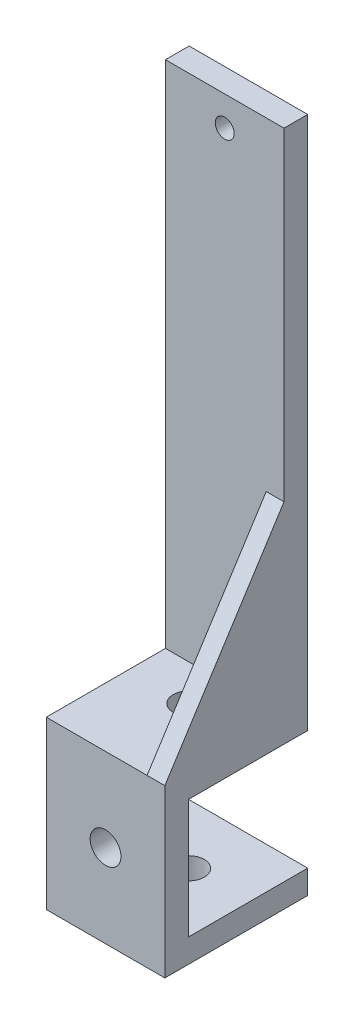
ISO-10303-21;
HEADER;
FILE_DESCRIPTION(('STEP AP214'),'2;1');
FILE_NAME('part.step','',(''),(''),'','','');
FILE_SCHEMA(('AUTOMOTIVE_DESIGN { 1 0 10303 214 1 1 1 1 }'));
ENDSEC;
DATA;
#1=APPLICATION_CONTEXT('core data for automotive mechanical design processes');
#2=APPLICATION_PROTOCOL_DEFINITION('international standard','automotive_design',2000,#1);
#3=PRODUCT_CONTEXT('',#1,'mechanical');
#4=PRODUCT('Part','Part','',(#3));
#5=PRODUCT_RELATED_PRODUCT_CATEGORY('part','',(#4));
#6=PRODUCT_DEFINITION_FORMATION('','',#4);
#7=PRODUCT_DEFINITION_CONTEXT('part definition',#1,'design');
#8=PRODUCT_DEFINITION('design','',#6,#7);
#9=PRODUCT_DEFINITION_SHAPE('','',#8);
#10=(LENGTH_UNIT() NAMED_UNIT(*) SI_UNIT(.MILLI.,.METRE.));
#11=(NAMED_UNIT(*) PLANE_ANGLE_UNIT() SI_UNIT($,.RADIAN.));
#12=(NAMED_UNIT(*) SI_UNIT($,.STERADIAN.) SOLID_ANGLE_UNIT());
#13=UNCERTAINTY_MEASURE_WITH_UNIT(LENGTH_MEASURE(1.E-05),#10,'distance_accuracy_value','');
#14=(GEOMETRIC_REPRESENTATION_CONTEXT(3) GLOBAL_UNCERTAINTY_ASSIGNED_CONTEXT((#13)) GLOBAL_UNIT_ASSIGNED_CONTEXT((#10,
#11,#12)) REPRESENTATION_CONTEXT('',''));
#15=CARTESIAN_POINT('',(0.,0.,0.));
#16=DIRECTION('',(0.,0.,1.));
#17=DIRECTION('',(1.,0.,0.));
#18=AXIS2_PLACEMENT_3D('',#15,#16,#17);
#19=CARTESIAN_POINT('',(-9.20967706060124,-71.3608856625275,20.1));
#20=DIRECTION('',(0.,0.,1.));
#21=DIRECTION('',(1.,0.,0.));
#22=AXIS2_PLACEMENT_3D('',#19,#20,#21);
#23=PLANE('',#22);
#24=CARTESIAN_POINT('',(-19.2096770606013,-57.3108856625275,20.1));
#25=DIRECTION('',(0.,0.,-1.));
#26=DIRECTION('',(-1.,0.,0.));
#27=AXIS2_PLACEMENT_3D('',#24,#25,#26);
#28=CIRCLE('',#27,2.6);
#29=CARTESIAN_POINT('',(-21.8096770606012,-57.3108856625275,20.1));
#30=VERTEX_POINT('',#29);
#31=EDGE_CURVE('E180',#30,#30,#28,.T.);
#32=ORIENTED_EDGE('',*,*,#31,.F.);
#33=EDGE_LOOP('',(#32));
#34=FACE_BOUND('',#33,.T.);
#35=DIRECTION('',(1.,0.,0.));
#36=VECTOR('',#35,1.);
#37=CARTESIAN_POINT('',(-9.20967706060124,-67.3608856625275,20.1));
#38=LINE('',#37,#36);
#39=CARTESIAN_POINT('',(-29.2096770606013,-67.3608856625275,20.1));
#40=VERTEX_POINT('',#39);
#41=CARTESIAN_POINT('',(-9.20967706060124,-67.3608856625275,20.1));
#42=VERTEX_POINT('',#41);
#43=EDGE_CURVE('E194',#40,#42,#38,.T.);
#44=ORIENTED_EDGE('',*,*,#43,.F.);
#45=DIRECTION('',(0.,1.,0.));
#46=VECTOR('',#45,1.);
#47=CARTESIAN_POINT('',(-29.2096770606013,-71.3608856625275,20.1));
#48=LINE('',#47,#46);
#49=CARTESIAN_POINT('',(-29.2096770606013,-47.2608856625275,20.1));
#50=VERTEX_POINT('',#49);
#51=EDGE_CURVE('E65',#40,#50,#48,.T.);
#52=ORIENTED_EDGE('',*,*,#51,.T.);
#53=DIRECTION('',(1.,0.,0.));
#54=VECTOR('',#53,1.);
#55=CARTESIAN_POINT('',(-9.20967706060125,-47.2608856625275,20.1));
#56=LINE('',#55,#54);
#57=CARTESIAN_POINT('',(-9.20967706060125,-47.2608856625275,20.1));
#58=VERTEX_POINT('',#57);
#59=EDGE_CURVE('E213',#50,#58,#56,.T.);
#60=ORIENTED_EDGE('',*,*,#59,.T.);
#61=DIRECTION('',(0.,1.,0.));
#62=VECTOR('',#61,1.);
#63=CARTESIAN_POINT('',(-9.20967706060124,-71.3608856625275,20.1));
#64=LINE('',#63,#62);
#65=EDGE_CURVE('E225',#42,#58,#64,.T.);
#66=ORIENTED_EDGE('',*,*,#65,.F.);
#67=EDGE_LOOP('',(#44,#52,#60,#66));
#68=FACE_BOUND('',#67,.T.);
#69=ADVANCED_FACE('F39',(#34,#68),#23,.F.);
#70=CARTESIAN_POINT('',(-9.20967706060125,-47.2608856625275,4.));
#71=DIRECTION('',(0.,1.,0.));
#72=DIRECTION('',(-1.,0.,0.));
#73=AXIS2_PLACEMENT_3D('',#70,#71,#72);
#74=PLANE('',#73);
#75=CARTESIAN_POINT('',(-19.2096770606013,-47.2608856625275,10.094759339097));
#76=DIRECTION('',(0.,-1.,0.));
#77=DIRECTION('',(1.,0.,0.));
#78=AXIS2_PLACEMENT_3D('',#75,#76,#77);
#79=CIRCLE('',#78,2.6);
#80=CARTESIAN_POINT('',(-16.6096770606013,-47.2608856625275,10.094759339097));
#81=VERTEX_POINT('',#80);
#82=EDGE_CURVE('E184',#81,#81,#79,.T.);
#83=ORIENTED_EDGE('',*,*,#82,.F.);
#84=EDGE_LOOP('',(#83));
#85=FACE_BOUND('',#84,.T.);
#86=ORIENTED_EDGE('',*,*,#59,.F.);
#87=DIRECTION('',(0.,0.,-1.));
#88=VECTOR('',#87,1.);
#89=CARTESIAN_POINT('',(-29.2096770606013,-47.2608856625275,4.));
#90=LINE('',#89,#88);
#91=CARTESIAN_POINT('',(-29.2096770606013,-47.2608856625275,0.));
#92=VERTEX_POINT('',#91);
#93=EDGE_CURVE('E277',#50,#92,#90,.T.);
#94=ORIENTED_EDGE('',*,*,#93,.T.);
#95=DIRECTION('',(1.,0.,0.));
#96=VECTOR('',#95,1.);
#97=CARTESIAN_POINT('',(-9.20967706060125,-47.2608856625275,0.));
#98=LINE('',#97,#96);
#99=CARTESIAN_POINT('',(-9.20967706060125,-47.2608856625275,0.));
#100=VERTEX_POINT('',#99);
#101=EDGE_CURVE('E255',#92,#100,#98,.T.);
#102=ORIENTED_EDGE('',*,*,#101,.T.);
#103=DIRECTION('',(0.,0.,-1.));
#104=VECTOR('',#103,1.);
#105=CARTESIAN_POINT('',(-9.20967706060125,-47.2608856625275,4.));
#106=LINE('',#105,#104);
#107=EDGE_CURVE('E261',#58,#100,#106,.T.);
#108=ORIENTED_EDGE('',*,*,#107,.F.);
#109=EDGE_LOOP('',(#86,#94,#102,#108));
#110=FACE_BOUND('',#109,.T.);
#111=ADVANCED_FACE('F306',(#85,#110),#74,.F.);
#112=CARTESIAN_POINT('',(0.,0.,4.));
#113=DIRECTION('',(0.,0.,-1.));
#114=DIRECTION('',(-1.,0.,0.));
#115=AXIS2_PLACEMENT_3D('',#112,#113,#114);
#116=PLANE('',#115);
#117=CARTESIAN_POINT('',(-19.2096770606013,37.7391143374725,4.));
#118=DIRECTION('',(0.,0.,-1.));
#119=DIRECTION('',(-1.,0.,0.));
#120=AXIS2_PLACEMENT_3D('',#117,#118,#119);
#121=CIRCLE('',#120,1.6);
#122=CARTESIAN_POINT('',(-20.8096770606013,37.7391143374725,4.));
#123=VERTEX_POINT('',#122);
#124=EDGE_CURVE('E168',#123,#123,#121,.T.);
#125=ORIENTED_EDGE('',*,*,#124,.T.);
#126=EDGE_LOOP('',(#125));
#127=FACE_BOUND('',#126,.T.);
#128=CARTESIAN_POINT('',(-19.2096770606013,-38.2608856625275,4.));
#129=DIRECTION('',(0.,0.,-1.));
#130=DIRECTION('',(-1.,0.,0.));
#131=AXIS2_PLACEMENT_3D('',#128,#129,#130);
#132=CIRCLE('',#131,1.6);
#133=CARTESIAN_POINT('',(-20.8096770606013,-38.2608856625275,4.));
#134=VERTEX_POINT('',#133);
#135=EDGE_CURVE('E161',#134,#134,#132,.T.);
#136=ORIENTED_EDGE('',*,*,#135,.T.);
#137=EDGE_LOOP('',(#136));
#138=FACE_BOUND('',#137,.T.);
#139=DIRECTION('',(0.,1.,0.));
#140=VECTOR('',#139,1.);
#141=CARTESIAN_POINT('',(-12.2096770606013,-11.8482809730409,4.));
#142=LINE('',#141,#140);
#143=CARTESIAN_POINT('',(-12.2096770606012,-43.2608856625275,4.));
#144=VERTEX_POINT('',#143);
#145=CARTESIAN_POINT('',(-12.2096770606013,-11.8482809730409,4.));
#146=VERTEX_POINT('',#145);
#147=EDGE_CURVE('E143',#144,#146,#142,.T.);
#148=ORIENTED_EDGE('',*,*,#147,.T.);
#149=DIRECTION('',(1.,0.,0.));
#150=VECTOR('',#149,1.);
#151=CARTESIAN_POINT('',(-12.2096770606013,-11.8482809730409,4.));
#152=LINE('',#151,#150);
#153=CARTESIAN_POINT('',(-9.20967706060125,-11.8482809730409,4.));
#154=VERTEX_POINT('',#153);
#155=EDGE_CURVE('E130',#146,#154,#152,.T.);
#156=ORIENTED_EDGE('',*,*,#155,.T.);
#157=DIRECTION('',(0.,1.,0.));
#158=VECTOR('',#157,1.);
#159=CARTESIAN_POINT('',(-9.20967706060126,42.7391143374725,4.));
#160=LINE('',#159,#158);
#161=CARTESIAN_POINT('',(-9.20967706060126,42.7391143374725,4.));
#162=VERTEX_POINT('',#161);
#163=EDGE_CURVE('E251',#154,#162,#160,.T.);
#164=ORIENTED_EDGE('',*,*,#163,.T.);
#165=DIRECTION('',(-1.,0.,0.));
#166=VECTOR('',#165,1.);
#167=CARTESIAN_POINT('',(-9.20967706060126,42.7391143374725,4.));
#168=LINE('',#167,#166);
#169=CARTESIAN_POINT('',(-29.2096770606013,42.7391143374725,4.));
#170=VERTEX_POINT('',#169);
#171=EDGE_CURVE('E254',#162,#170,#168,.T.);
#172=ORIENTED_EDGE('',*,*,#171,.T.);
#173=DIRECTION('',(0.,-1.,0.));
#174=VECTOR('',#173,1.);
#175=CARTESIAN_POINT('',(-29.2096770606013,42.7391143374725,4.));
#176=LINE('',#175,#174);
#177=CARTESIAN_POINT('',(-29.2096770606013,-43.2608856625275,4.));
#178=VERTEX_POINT('',#177);
#179=EDGE_CURVE('E258',#170,#178,#176,.T.);
#180=ORIENTED_EDGE('',*,*,#179,.T.);
#181=DIRECTION('',(-1.,0.,0.));
#182=VECTOR('',#181,1.);
#183=CARTESIAN_POINT('',(-29.2096770606013,-43.2608856625275,4.));
#184=LINE('',#183,#182);
#185=EDGE_CURVE('E149',#144,#178,#184,.T.);
#186=ORIENTED_EDGE('',*,*,#185,.F.);
#187=EDGE_LOOP('',(#148,#156,#164,#172,#180,#186));
#188=FACE_BOUND('',#187,.T.);
#189=ADVANCED_FACE('F147',(#127,#138,#188),#116,.F.);
#190=CARTESIAN_POINT('',(-9.20967706060126,42.7391143374725,4.));
#191=DIRECTION('',(-1.,0.,0.));
#192=DIRECTION('',(0.,-1.,0.));
#193=AXIS2_PLACEMENT_3D('',#190,#191,#192);
#194=PLANE('',#193);
#195=ORIENTED_EDGE('',*,*,#163,.F.);
#196=DIRECTION('',(0.,-0.842320911565754,0.538976327809522));
#197=VECTOR('',#196,1.);
#198=CARTESIAN_POINT('',(-9.20967706060125,-11.8482809730409,4.));
#199=LINE('',#198,#197);
#200=CARTESIAN_POINT('',(-9.20967706060125,-43.2608856625275,24.1));
#201=VERTEX_POINT('',#200);
#202=EDGE_CURVE('E135',#154,#201,#199,.T.);
#203=ORIENTED_EDGE('',*,*,#202,.T.);
#204=DIRECTION('',(0.,1.,0.));
#205=VECTOR('',#204,1.);
#206=CARTESIAN_POINT('',(-9.20967706060125,-47.2608856625275,24.1));
#207=LINE('',#206,#205);
#208=CARTESIAN_POINT('',(-9.20967706060124,-71.3608856625275,24.1));
#209=VERTEX_POINT('',#208);
#210=EDGE_CURVE('E235',#209,#201,#207,.T.);
#211=ORIENTED_EDGE('',*,*,#210,.F.);
#212=DIRECTION('',(0.,0.,1.));
#213=VECTOR('',#212,1.);
#214=CARTESIAN_POINT('',(-9.20967706060124,-71.3608856625275,20.1));
#215=LINE('',#214,#213);
#216=CARTESIAN_POINT('',(-9.20967706060124,-71.3608856625275,0.));
#217=VERTEX_POINT('',#216);
#218=EDGE_CURVE('E214',#217,#209,#215,.T.);
#219=ORIENTED_EDGE('',*,*,#218,.F.);
#220=DIRECTION('',(0.,-1.,0.));
#221=VECTOR('',#220,1.);
#222=CARTESIAN_POINT('',(-9.20967706060124,-67.3608856625275,0.));
#223=LINE('',#222,#221);
#224=CARTESIAN_POINT('',(-9.20967706060124,-67.3608856625275,0.));
#225=VERTEX_POINT('',#224);
#226=EDGE_CURVE('E189',#225,#217,#223,.T.);
#227=ORIENTED_EDGE('',*,*,#226,.F.);
#228=DIRECTION('',(0.,0.,1.));
#229=VECTOR('',#228,1.);
#230=CARTESIAN_POINT('',(-9.20967706060124,-67.3608856625275,0.));
#231=LINE('',#230,#229);
#232=EDGE_CURVE('E204',#225,#42,#231,.T.);
#233=ORIENTED_EDGE('',*,*,#232,.T.);
#234=ORIENTED_EDGE('',*,*,#65,.T.);
#235=ORIENTED_EDGE('',*,*,#107,.T.);
#236=DIRECTION('',(0.,1.,0.));
#237=VECTOR('',#236,1.);
#238=CARTESIAN_POINT('',(-9.20967706060126,42.7391143374725,0.));
#239=LINE('',#238,#237);
#240=CARTESIAN_POINT('',(-9.20967706060126,42.7391143374725,0.));
#241=VERTEX_POINT('',#240);
#242=EDGE_CURVE('E250',#100,#241,#239,.T.);
#243=ORIENTED_EDGE('',*,*,#242,.T.);
#244=DIRECTION('',(0.,0.,-1.));
#245=VECTOR('',#244,1.);
#246=CARTESIAN_POINT('',(-9.20967706060126,42.7391143374725,4.));
#247=LINE('',#246,#245);
#248=EDGE_CURVE('E11',#162,#241,#247,.T.);
#249=ORIENTED_EDGE('',*,*,#248,.F.);
#250=EDGE_LOOP('',(#195,#203,#211,#219,#227,#233,#234,#235,#243,#249));
#251=FACE_BOUND('',#250,.T.);
#252=ADVANCED_FACE('F41',(#251),#194,.F.);
#253=CARTESIAN_POINT('',(-9.20967706060126,42.7391143374725,4.));
#254=DIRECTION('',(0.,-1.,0.));
#255=DIRECTION('',(0.,0.,-1.));
#256=AXIS2_PLACEMENT_3D('',#253,#254,#255);
#257=PLANE('',#256);
#258=DIRECTION('',(-1.,0.,0.));
#259=VECTOR('',#258,1.);
#260=CARTESIAN_POINT('',(-9.20967706060126,42.7391143374725,0.));
#261=LINE('',#260,#259);
#262=CARTESIAN_POINT('',(-29.2096770606013,42.7391143374725,0.));
#263=VERTEX_POINT('',#262);
#264=EDGE_CURVE('E265',#241,#263,#261,.T.);
#265=ORIENTED_EDGE('',*,*,#264,.T.);
#266=DIRECTION('',(0.,0.,-1.));
#267=VECTOR('',#266,1.);
#268=CARTESIAN_POINT('',(-29.2096770606013,42.7391143374725,4.));
#269=LINE('',#268,#267);
#270=EDGE_CURVE('E49',#170,#263,#269,.T.);
#271=ORIENTED_EDGE('',*,*,#270,.F.);
#272=ORIENTED_EDGE('',*,*,#171,.F.);
#273=ORIENTED_EDGE('',*,*,#248,.T.);
#274=EDGE_LOOP('',(#265,#271,#272,#273));
#275=FACE_BOUND('',#274,.T.);
#276=ADVANCED_FACE('F334',(#275),#257,.F.);
#277=CARTESIAN_POINT('',(-29.2096770606013,42.7391143374725,4.));
#278=DIRECTION('',(1.,0.,0.));
#279=DIRECTION('',(0.,0.,-1.));
#280=AXIS2_PLACEMENT_3D('',#277,#278,#279);
#281=PLANE('',#280);
#282=DIRECTION('',(0.,-1.,0.));
#283=VECTOR('',#282,1.);
#284=CARTESIAN_POINT('',(-29.2096770606013,42.7391143374725,0.));
#285=LINE('',#284,#283);
#286=EDGE_CURVE('E268',#263,#92,#285,.T.);
#287=ORIENTED_EDGE('',*,*,#286,.T.);
#288=ORIENTED_EDGE('',*,*,#93,.F.);
#289=ORIENTED_EDGE('',*,*,#51,.F.);
#290=DIRECTION('',(0.,0.,1.));
#291=VECTOR('',#290,1.);
#292=CARTESIAN_POINT('',(-29.2096770606013,-67.3608856625275,0.));
#293=LINE('',#292,#291);
#294=CARTESIAN_POINT('',(-29.2096770606013,-67.3608856625275,0.));
#295=VERTEX_POINT('',#294);
#296=EDGE_CURVE('E210',#295,#40,#293,.T.);
#297=ORIENTED_EDGE('',*,*,#296,.F.);
#298=DIRECTION('',(0.,1.,0.));
#299=VECTOR('',#298,1.);
#300=CARTESIAN_POINT('',(-29.2096770606013,-71.3608856625275,0.));
#301=LINE('',#300,#299);
#302=CARTESIAN_POINT('',(-29.2096770606013,-71.3608856625275,0.));
#303=VERTEX_POINT('',#302);
#304=EDGE_CURVE('E198',#303,#295,#301,.T.);
#305=ORIENTED_EDGE('',*,*,#304,.F.);
#306=DIRECTION('',(0.,0.,-1.));
#307=VECTOR('',#306,1.);
#308=CARTESIAN_POINT('',(-29.2096770606013,-71.3608856625275,24.1));
#309=LINE('',#308,#307);
#310=CARTESIAN_POINT('',(-29.2096770606013,-71.3608856625275,24.1));
#311=VERTEX_POINT('',#310);
#312=EDGE_CURVE('E222',#311,#303,#309,.T.);
#313=ORIENTED_EDGE('',*,*,#312,.F.);
#314=DIRECTION('',(0.,-1.,0.));
#315=VECTOR('',#314,1.);
#316=CARTESIAN_POINT('',(-29.2096770606013,-43.2608856625275,24.1));
#317=LINE('',#316,#315);
#318=CARTESIAN_POINT('',(-29.2096770606013,-43.2608856625275,24.1));
#319=VERTEX_POINT('',#318);
#320=EDGE_CURVE('E232',#319,#311,#317,.T.);
#321=ORIENTED_EDGE('',*,*,#320,.F.);
#322=DIRECTION('',(0.,0.,-1.));
#323=VECTOR('',#322,1.);
#324=CARTESIAN_POINT('',(-29.2096770606013,-43.2608856625275,24.1));
#325=LINE('',#324,#323);
#326=EDGE_CURVE('E244',#319,#178,#325,.T.);
#327=ORIENTED_EDGE('',*,*,#326,.T.);
#328=ORIENTED_EDGE('',*,*,#179,.F.);
#329=ORIENTED_EDGE('',*,*,#270,.T.);
#330=EDGE_LOOP('',(#287,#288,#289,#297,#305,#313,#321,#327,#328,#329));
#331=FACE_BOUND('',#330,.T.);
#332=ADVANCED_FACE('F330',(#331),#281,.F.);
#333=CARTESIAN_POINT('',(0.,0.,0.));
#334=DIRECTION('',(0.,0.,-1.));
#335=DIRECTION('',(-1.,0.,0.));
#336=AXIS2_PLACEMENT_3D('',#333,#334,#335);
#337=PLANE('',#336);
#338=CARTESIAN_POINT('',(-19.2096770606013,37.7391143374725,0.));
#339=DIRECTION('',(0.,0.,-1.));
#340=DIRECTION('',(-1.,0.,0.));
#341=AXIS2_PLACEMENT_3D('',#338,#339,#340);
#342=CIRCLE('',#341,1.6);
#343=CARTESIAN_POINT('',(-20.8096770606013,37.7391143374725,0.));
#344=VERTEX_POINT('',#343);
#345=EDGE_CURVE('E157',#344,#344,#342,.T.);
#346=ORIENTED_EDGE('',*,*,#345,.F.);
#347=EDGE_LOOP('',(#346));
#348=FACE_BOUND('',#347,.T.);
#349=CARTESIAN_POINT('',(-19.2096770606013,-38.2608856625275,0.));
#350=DIRECTION('',(0.,0.,-1.));
#351=DIRECTION('',(-1.,0.,0.));
#352=AXIS2_PLACEMENT_3D('',#349,#350,#351);
#353=CIRCLE('',#352,1.6);
#354=CARTESIAN_POINT('',(-20.8096770606013,-38.2608856625275,0.));
#355=VERTEX_POINT('',#354);
#356=EDGE_CURVE('E140',#355,#355,#353,.T.);
#357=ORIENTED_EDGE('',*,*,#356,.F.);
#358=EDGE_LOOP('',(#357));
#359=FACE_BOUND('',#358,.T.);
#360=ORIENTED_EDGE('',*,*,#242,.F.);
#361=ORIENTED_EDGE('',*,*,#101,.F.);
#362=ORIENTED_EDGE('',*,*,#286,.F.);
#363=ORIENTED_EDGE('',*,*,#264,.F.);
#364=EDGE_LOOP('',(#360,#361,#362,#363));
#365=FACE_BOUND('',#364,.T.);
#366=ADVANCED_FACE('F325',(#348,#359,#365),#337,.T.);
#367=CARTESIAN_POINT('',(-29.2096770606013,-43.2608856625275,24.1));
#368=DIRECTION('',(0.,-1.,0.));
#369=DIRECTION('',(1.,0.,0.));
#370=AXIS2_PLACEMENT_3D('',#367,#368,#369);
#371=PLANE('',#370);
#372=CARTESIAN_POINT('',(-19.2096770606013,-43.2608856625275,10.094759339097));
#373=DIRECTION('',(0.,-1.,0.));
#374=DIRECTION('',(1.,0.,0.));
#375=AXIS2_PLACEMENT_3D('',#372,#373,#374);
#376=CIRCLE('',#375,2.6);
#377=CARTESIAN_POINT('',(-16.6096770606013,-43.2608856625275,10.094759339097));
#378=VERTEX_POINT('',#377);
#379=EDGE_CURVE('E188',#378,#378,#376,.T.);
#380=ORIENTED_EDGE('',*,*,#379,.T.);
#381=EDGE_LOOP('',(#380));
#382=FACE_BOUND('',#381,.T.);
#383=DIRECTION('',(-1.,0.,0.));
#384=VECTOR('',#383,1.);
#385=CARTESIAN_POINT('',(-29.2096770606013,-43.2608856625275,24.1));
#386=LINE('',#385,#384);
#387=CARTESIAN_POINT('',(-12.2096770606013,-43.2608856625275,24.1));
#388=VERTEX_POINT('',#387);
#389=EDGE_CURVE('E239',#388,#319,#386,.T.);
#390=ORIENTED_EDGE('',*,*,#389,.F.);
#391=DIRECTION('',(0.,0.,-1.));
#392=VECTOR('',#391,1.);
#393=CARTESIAN_POINT('',(-12.2096770606012,-43.2608856625275,4.));
#394=LINE('',#393,#392);
#395=EDGE_CURVE('E57',#388,#144,#394,.T.);
#396=ORIENTED_EDGE('',*,*,#395,.T.);
#397=ORIENTED_EDGE('',*,*,#185,.T.);
#398=ORIENTED_EDGE('',*,*,#326,.F.);
#399=EDGE_LOOP('',(#390,#396,#397,#398));
#400=FACE_BOUND('',#399,.T.);
#401=ADVANCED_FACE('F286',(#382,#400),#371,.F.);
#402=CARTESIAN_POINT('',(0.,0.,24.1));
#403=DIRECTION('',(0.,0.,1.));
#404=DIRECTION('',(1.,0.,0.));
#405=AXIS2_PLACEMENT_3D('',#402,#403,#404);
#406=PLANE('',#405);
#407=CARTESIAN_POINT('',(-19.2096770606013,-57.3108856625275,24.1));
#408=DIRECTION('',(0.,0.,1.));
#409=DIRECTION('',(1.,0.,0.));
#410=AXIS2_PLACEMENT_3D('',#407,#408,#409);
#411=CIRCLE('',#410,2.6);
#412=CARTESIAN_POINT('',(-16.6096770606013,-57.3108856625275,24.1));
#413=VERTEX_POINT('',#412);
#414=EDGE_CURVE('E43',#413,#413,#411,.T.);
#415=ORIENTED_EDGE('',*,*,#414,.F.);
#416=EDGE_LOOP('',(#415));
#417=FACE_BOUND('',#416,.T.);
#418=ORIENTED_EDGE('',*,*,#320,.T.);
#419=DIRECTION('',(-1.,0.,0.));
#420=VECTOR('',#419,1.);
#421=CARTESIAN_POINT('',(-9.20967706060124,-71.3608856625275,24.1));
#422=LINE('',#421,#420);
#423=EDGE_CURVE('E218',#209,#311,#422,.T.);
#424=ORIENTED_EDGE('',*,*,#423,.F.);
#425=ORIENTED_EDGE('',*,*,#210,.T.);
#426=EDGE_CURVE('E240',#201,#388,#386,.T.);
#427=ORIENTED_EDGE('',*,*,#426,.T.);
#428=ORIENTED_EDGE('',*,*,#389,.T.);
#429=EDGE_LOOP('',(#418,#424,#425,#427,#428));
#430=FACE_BOUND('',#429,.T.);
#431=ADVANCED_FACE('F319',(#417,#430),#406,.T.);
#432=CARTESIAN_POINT('',(0.,-71.3608856625275,0.));
#433=DIRECTION('',(0.,-1.,0.));
#434=DIRECTION('',(1.,0.,0.));
#435=AXIS2_PLACEMENT_3D('',#432,#433,#434);
#436=PLANE('',#435);
#437=CARTESIAN_POINT('',(-19.2096770606012,-71.3608856625275,10.05));
#438=DIRECTION('',(0.,-1.,0.));
#439=DIRECTION('',(1.,0.,0.));
#440=AXIS2_PLACEMENT_3D('',#437,#438,#439);
#441=CIRCLE('',#440,2.6);
#442=CARTESIAN_POINT('',(-16.6096770606012,-71.3608856625275,10.05));
#443=VERTEX_POINT('',#442);
#444=EDGE_CURVE('E176',#443,#443,#441,.T.);
#445=ORIENTED_EDGE('',*,*,#444,.F.);
#446=EDGE_LOOP('',(#445));
#447=FACE_BOUND('',#446,.T.);
#448=ORIENTED_EDGE('',*,*,#218,.T.);
#449=ORIENTED_EDGE('',*,*,#423,.T.);
#450=ORIENTED_EDGE('',*,*,#312,.T.);
#451=DIRECTION('',(-1.,0.,0.));
#452=VECTOR('',#451,1.);
#453=CARTESIAN_POINT('',(-9.20967706060124,-71.3608856625275,0.));
#454=LINE('',#453,#452);
#455=EDGE_CURVE('E193',#217,#303,#454,.T.);
#456=ORIENTED_EDGE('',*,*,#455,.F.);
#457=EDGE_LOOP('',(#448,#449,#450,#456));
#458=FACE_BOUND('',#457,.T.);
#459=ADVANCED_FACE('F317',(#447,#458),#436,.T.);
#460=CARTESIAN_POINT('',(-9.20967706060124,-67.3608856625275,0.));
#461=DIRECTION('',(0.,-1.,0.));
#462=DIRECTION('',(0.,0.,-1.));
#463=AXIS2_PLACEMENT_3D('',#460,#461,#462);
#464=PLANE('',#463);
#465=CARTESIAN_POINT('',(-19.2096770606012,-67.3608856625275,10.05));
#466=DIRECTION('',(0.,1.,0.));
#467=DIRECTION('',(0.,0.,1.));
#468=AXIS2_PLACEMENT_3D('',#465,#466,#467);
#469=CIRCLE('',#468,2.6);
#470=CARTESIAN_POINT('',(-19.2096770606012,-67.3608856625275,12.65));
#471=VERTEX_POINT('',#470);
#472=EDGE_CURVE('E172',#471,#471,#469,.T.);
#473=ORIENTED_EDGE('',*,*,#472,.F.);
#474=EDGE_LOOP('',(#473));
#475=FACE_BOUND('',#474,.T.);
#476=ORIENTED_EDGE('',*,*,#43,.T.);
#477=ORIENTED_EDGE('',*,*,#232,.F.);
#478=DIRECTION('',(1.,0.,0.));
#479=VECTOR('',#478,1.);
#480=CARTESIAN_POINT('',(-9.20967706060124,-67.3608856625275,0.));
#481=LINE('',#480,#479);
#482=EDGE_CURVE('E201',#295,#225,#481,.T.);
#483=ORIENTED_EDGE('',*,*,#482,.F.);
#484=ORIENTED_EDGE('',*,*,#296,.T.);
#485=EDGE_LOOP('',(#476,#477,#483,#484));
#486=FACE_BOUND('',#485,.T.);
#487=ADVANCED_FACE('F302',(#475,#486),#464,.F.);
#488=CARTESIAN_POINT('',(0.,0.,0.));
#489=DIRECTION('',(0.,0.,-1.));
#490=DIRECTION('',(-1.,0.,0.));
#491=AXIS2_PLACEMENT_3D('',#488,#489,#490);
#492=PLANE('',#491);
#493=ORIENTED_EDGE('',*,*,#226,.T.);
#494=ORIENTED_EDGE('',*,*,#455,.T.);
#495=ORIENTED_EDGE('',*,*,#304,.T.);
#496=ORIENTED_EDGE('',*,*,#482,.T.);
#497=EDGE_LOOP('',(#493,#494,#495,#496));
#498=FACE_BOUND('',#497,.T.);
#499=ADVANCED_FACE('F292',(#498),#492,.T.);
#500=CARTESIAN_POINT('',(-19.2096770606013,-27.2608856625275,10.094759339097));
#501=DIRECTION('',(0.,-1.,0.));
#502=DIRECTION('',(1.,0.,0.));
#503=AXIS2_PLACEMENT_3D('',#500,#501,#502);
#504=CYLINDRICAL_SURFACE('',#503,2.6);
#505=ORIENTED_EDGE('',*,*,#82,.T.);
#506=EDGE_LOOP('',(#505));
#507=FACE_BOUND('',#506,.T.);
#508=ORIENTED_EDGE('',*,*,#379,.F.);
#509=EDGE_LOOP('',(#508));
#510=FACE_BOUND('',#509,.T.);
#511=ADVANCED_FACE('F289',(#507,#510),#504,.F.);
#512=CARTESIAN_POINT('',(-19.2096770606013,-57.3108856625275,40.1));
#513=DIRECTION('',(0.,0.,-1.));
#514=DIRECTION('',(-1.,0.,0.));
#515=AXIS2_PLACEMENT_3D('',#512,#513,#514);
#516=CYLINDRICAL_SURFACE('',#515,2.6);
#517=ORIENTED_EDGE('',*,*,#414,.T.);
#518=EDGE_LOOP('',(#517));
#519=FACE_BOUND('',#518,.T.);
#520=ORIENTED_EDGE('',*,*,#31,.T.);
#521=EDGE_LOOP('',(#520));
#522=FACE_BOUND('',#521,.T.);
#523=ADVANCED_FACE('F291',(#519,#522),#516,.F.);
#524=CARTESIAN_POINT('',(-19.2096770606012,-87.3608856625275,10.05));
#525=DIRECTION('',(0.,1.,0.));
#526=DIRECTION('',(0.,0.,1.));
#527=AXIS2_PLACEMENT_3D('',#524,#525,#526);
#528=CYLINDRICAL_SURFACE('',#527,2.6);
#529=ORIENTED_EDGE('',*,*,#444,.T.);
#530=EDGE_LOOP('',(#529));
#531=FACE_BOUND('',#530,.T.);
#532=ORIENTED_EDGE('',*,*,#472,.T.);
#533=EDGE_LOOP('',(#532));
#534=FACE_BOUND('',#533,.T.);
#535=ADVANCED_FACE('F299',(#531,#534),#528,.F.);
#536=CARTESIAN_POINT('',(-19.2096770606013,-38.2608856625275,20.));
#537=DIRECTION('',(0.,0.,-1.));
#538=DIRECTION('',(-1.,0.,0.));
#539=AXIS2_PLACEMENT_3D('',#536,#537,#538);
#540=CYLINDRICAL_SURFACE('',#539,1.6);
#541=ORIENTED_EDGE('',*,*,#356,.T.);
#542=EDGE_LOOP('',(#541));
#543=FACE_BOUND('',#542,.T.);
#544=ORIENTED_EDGE('',*,*,#135,.F.);
#545=EDGE_LOOP('',(#544));
#546=FACE_BOUND('',#545,.T.);
#547=ADVANCED_FACE('F378',(#543,#546),#540,.F.);
#548=CARTESIAN_POINT('',(-19.2096770606013,37.7391143374725,20.));
#549=DIRECTION('',(0.,0.,-1.));
#550=DIRECTION('',(-1.,0.,0.));
#551=AXIS2_PLACEMENT_3D('',#548,#549,#550);
#552=CYLINDRICAL_SURFACE('',#551,1.6);
#553=ORIENTED_EDGE('',*,*,#345,.T.);
#554=EDGE_LOOP('',(#553));
#555=FACE_BOUND('',#554,.T.);
#556=ORIENTED_EDGE('',*,*,#124,.F.);
#557=EDGE_LOOP('',(#556));
#558=FACE_BOUND('',#557,.T.);
#559=ADVANCED_FACE('F384',(#555,#558),#552,.F.);
#560=CARTESIAN_POINT('',(-12.2096770606013,-11.8482809730409,4.));
#561=DIRECTION('',(0.,0.538976327809522,0.842320911565754));
#562=DIRECTION('',(0.,-0.842320911565754,0.538976327809522));
#563=AXIS2_PLACEMENT_3D('',#560,#561,#562);
#564=PLANE('',#563);
#565=ORIENTED_EDGE('',*,*,#202,.F.);
#566=ORIENTED_EDGE('',*,*,#155,.F.);
#567=DIRECTION('',(0.,-0.842320911565754,0.538976327809522));
#568=VECTOR('',#567,1.);
#569=CARTESIAN_POINT('',(-12.2096770606013,-11.8482809730409,4.));
#570=LINE('',#569,#568);
#571=EDGE_CURVE('E132',#146,#388,#570,.T.);
#572=ORIENTED_EDGE('',*,*,#571,.T.);
#573=ORIENTED_EDGE('',*,*,#426,.F.);
#574=EDGE_LOOP('',(#565,#566,#572,#573));
#575=FACE_BOUND('',#574,.T.);
#576=ADVANCED_FACE('F131',(#575),#564,.T.);
#577=CARTESIAN_POINT('',(-12.2096770606013,0.,0.));
#578=DIRECTION('',(-1.,0.,0.));
#579=DIRECTION('',(0.,-1.,0.));
#580=AXIS2_PLACEMENT_3D('',#577,#578,#579);
#581=PLANE('',#580);
#582=ORIENTED_EDGE('',*,*,#147,.F.);
#583=ORIENTED_EDGE('',*,*,#395,.F.);
#584=ORIENTED_EDGE('',*,*,#571,.F.);
#585=EDGE_LOOP('',(#582,#583,#584));
#586=FACE_BOUND('',#585,.T.);
#587=ADVANCED_FACE('F142',(#586),#581,.T.);
#588=CLOSED_SHELL('',(#69,#111,#189,#252,#276,#332,#366,#401,#431,#459,#487,#499,#511,#523,#535,
#547,#559,#576,#587));
#589=MANIFOLD_SOLID_BREP('B2',#588);
#590=ADVANCED_BREP_SHAPE_REPRESENTATION('',(#18,#589),#14);
#591=SHAPE_DEFINITION_REPRESENTATION(#9,#590);
ENDSEC;
END-ISO-10303-21;
